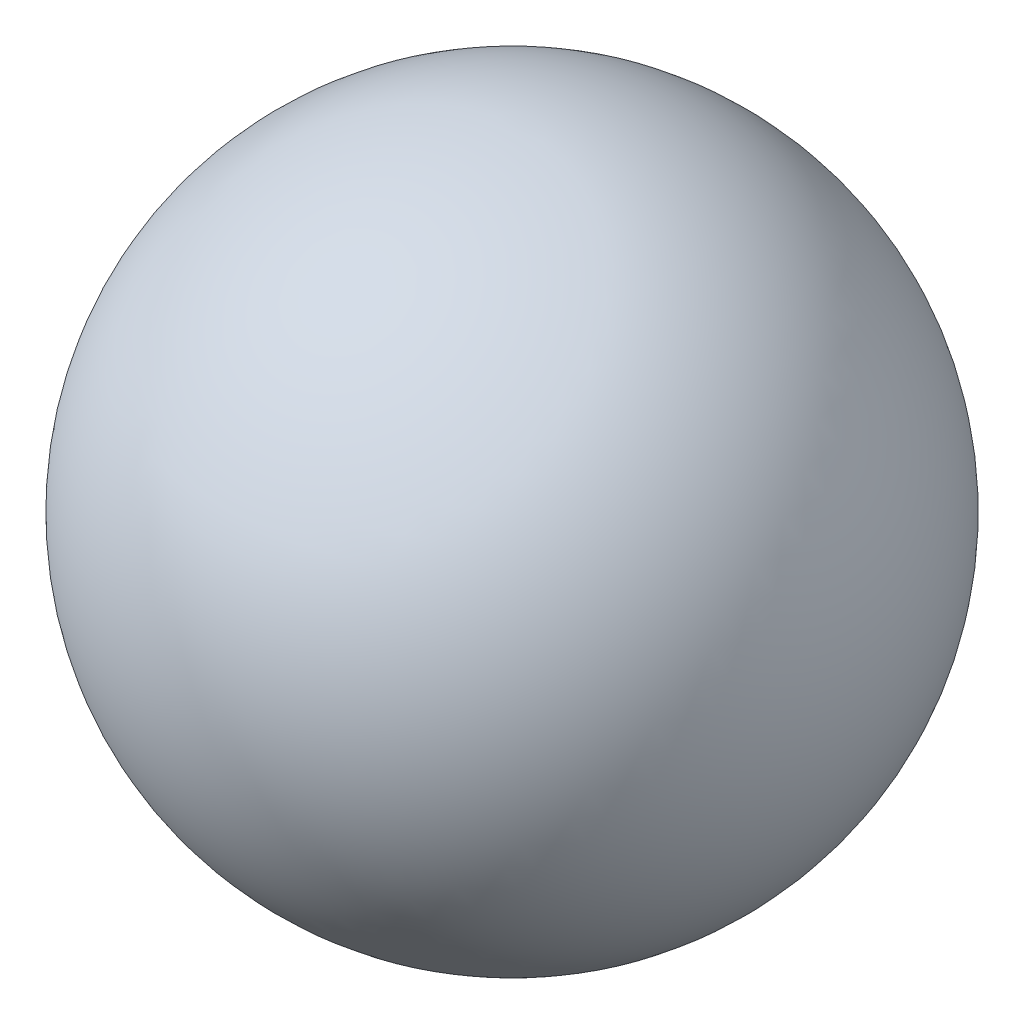
ISO-10303-21;
HEADER;
FILE_DESCRIPTION(('STEP AP214'),'2;1');
FILE_NAME('part.step','',(''),(''),'','','');
FILE_SCHEMA(('AUTOMOTIVE_DESIGN { 1 0 10303 214 1 1 1 1 }'));
ENDSEC;
DATA;
#1=APPLICATION_CONTEXT('core data for automotive mechanical design processes');
#2=APPLICATION_PROTOCOL_DEFINITION('international standard','automotive_design',2000,#1);
#3=PRODUCT_CONTEXT('',#1,'mechanical');
#4=PRODUCT('Part','Part','',(#3));
#5=PRODUCT_RELATED_PRODUCT_CATEGORY('part','',(#4));
#6=PRODUCT_DEFINITION_FORMATION('','',#4);
#7=PRODUCT_DEFINITION_CONTEXT('part definition',#1,'design');
#8=PRODUCT_DEFINITION('design','',#6,#7);
#9=PRODUCT_DEFINITION_SHAPE('','',#8);
#10=(LENGTH_UNIT() NAMED_UNIT(*) SI_UNIT(.MILLI.,.METRE.));
#11=(NAMED_UNIT(*) PLANE_ANGLE_UNIT() SI_UNIT($,.RADIAN.));
#12=(NAMED_UNIT(*) SI_UNIT($,.STERADIAN.) SOLID_ANGLE_UNIT());
#13=UNCERTAINTY_MEASURE_WITH_UNIT(LENGTH_MEASURE(1.E-05),#10,'distance_accuracy_value','');
#14=(GEOMETRIC_REPRESENTATION_CONTEXT(3) GLOBAL_UNCERTAINTY_ASSIGNED_CONTEXT((#13)) GLOBAL_UNIT_ASSIGNED_CONTEXT((#10,
#11,#12)) REPRESENTATION_CONTEXT('',''));
#15=CARTESIAN_POINT('',(0.,0.,0.));
#16=DIRECTION('',(0.,0.,1.));
#17=DIRECTION('',(1.,0.,0.));
#18=AXIS2_PLACEMENT_3D('',#15,#16,#17);
#19=CARTESIAN_POINT('',(0.,0.,0.));
#20=DIRECTION('',(0.,1.,0.));
#21=DIRECTION('',(1.,0.,0.));
#22=AXIS2_PLACEMENT_3D('',#19,#20,#21);
#23=SPHERICAL_SURFACE('',#22,9.5);
#24=CARTESIAN_POINT('',(0.,9.5,0.));
#25=VERTEX_POINT('',#24);
#26=VERTEX_LOOP('',#25);
#27=FACE_BOUND('',#26,.T.);
#28=ADVANCED_FACE('F28',(#27),#23,.T.);
#29=CLOSED_SHELL('',(#28));
#30=MANIFOLD_SOLID_BREP('B2',#29);
#31=ADVANCED_BREP_SHAPE_REPRESENTATION('',(#18,#30),#14);
#32=SHAPE_DEFINITION_REPRESENTATION(#9,#31);
ENDSEC;
END-ISO-10303-21;
